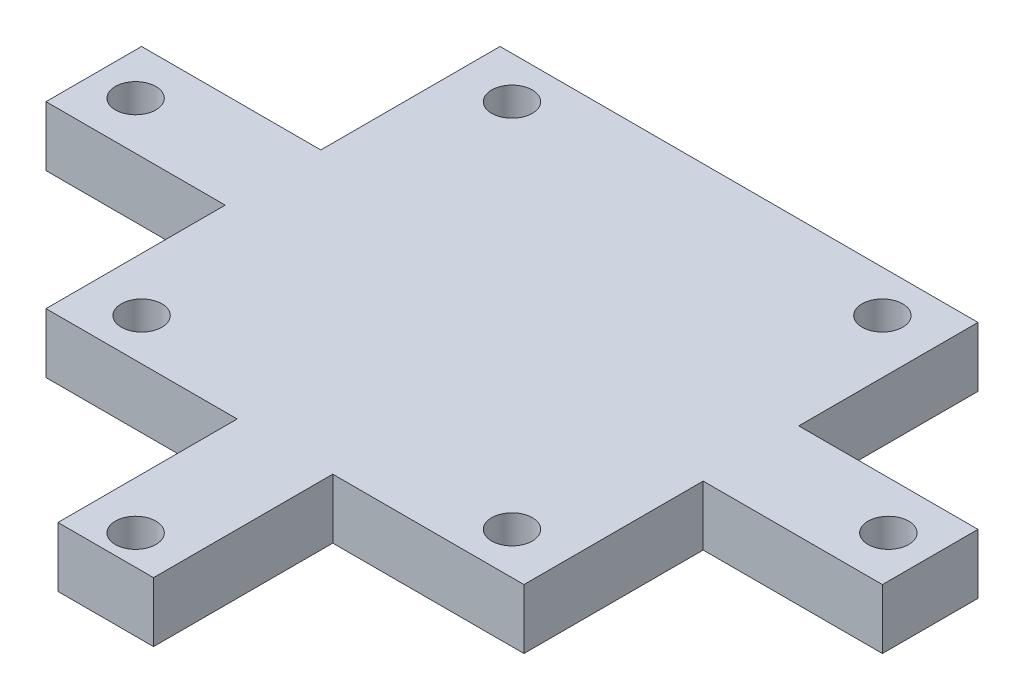
ISO-10303-21;
HEADER;
FILE_DESCRIPTION(('STEP AP214'),'2;1');
FILE_NAME('part.step','',(''),(''),'','','');
FILE_SCHEMA(('AUTOMOTIVE_DESIGN { 1 0 10303 214 1 1 1 1 }'));
ENDSEC;
DATA;
#1=APPLICATION_CONTEXT('core data for automotive mechanical design processes');
#2=APPLICATION_PROTOCOL_DEFINITION('international standard','automotive_design',2000,#1);
#3=PRODUCT_CONTEXT('',#1,'mechanical');
#4=PRODUCT('Part','Part','',(#3));
#5=PRODUCT_RELATED_PRODUCT_CATEGORY('part','',(#4));
#6=PRODUCT_DEFINITION_FORMATION('','',#4);
#7=PRODUCT_DEFINITION_CONTEXT('part definition',#1,'design');
#8=PRODUCT_DEFINITION('design','',#6,#7);
#9=PRODUCT_DEFINITION_SHAPE('','',#8);
#10=(LENGTH_UNIT() NAMED_UNIT(*) SI_UNIT(.MILLI.,.METRE.));
#11=(NAMED_UNIT(*) PLANE_ANGLE_UNIT() SI_UNIT($,.RADIAN.));
#12=(NAMED_UNIT(*) SI_UNIT($,.STERADIAN.) SOLID_ANGLE_UNIT());
#13=UNCERTAINTY_MEASURE_WITH_UNIT(LENGTH_MEASURE(1.E-05),#10,'distance_accuracy_value','');
#14=(GEOMETRIC_REPRESENTATION_CONTEXT(3) GLOBAL_UNCERTAINTY_ASSIGNED_CONTEXT((#13)) GLOBAL_UNIT_ASSIGNED_CONTEXT((#10,
#11,#12)) REPRESENTATION_CONTEXT('',''));
#15=CARTESIAN_POINT('',(0.,0.,0.));
#16=DIRECTION('',(0.,0.,1.));
#17=DIRECTION('',(1.,0.,0.));
#18=AXIS2_PLACEMENT_3D('',#15,#16,#17);
#19=CARTESIAN_POINT('',(0.,5.,0.));
#20=DIRECTION('',(0.,1.,0.));
#21=DIRECTION('',(0.,0.,1.));
#22=AXIS2_PLACEMENT_3D('',#19,#20,#21);
#23=PLANE('',#22);
#24=CARTESIAN_POINT('',(1.09981662173559E-13,5.,31.5));
#25=DIRECTION('',(0.,1.,0.));
#26=DIRECTION('',(0.,0.,1.));
#27=AXIS2_PLACEMENT_3D('',#24,#25,#26);
#28=CIRCLE('',#27,1.7);
#29=CARTESIAN_POINT('',(1.09981662173559E-13,5.,33.2));
#30=VERTEX_POINT('',#29);
#31=EDGE_CURVE('E355',#30,#30,#28,.T.);
#32=ORIENTED_EDGE('',*,*,#31,.F.);
#33=EDGE_LOOP('',(#32));
#34=FACE_BOUND('',#33,.T.);
#35=CARTESIAN_POINT('',(-15.4999999999991,5.,15.5));
#36=DIRECTION('',(0.,1.,0.));
#37=DIRECTION('',(0.,0.,1.));
#38=AXIS2_PLACEMENT_3D('',#35,#36,#37);
#39=CIRCLE('',#38,1.70000000000046);
#40=CARTESIAN_POINT('',(-15.4999999999991,5.,17.2000000000005));
#41=VERTEX_POINT('',#40);
#42=EDGE_CURVE('E367',#41,#41,#39,.T.);
#43=ORIENTED_EDGE('',*,*,#42,.F.);
#44=EDGE_LOOP('',(#43));
#45=FACE_BOUND('',#44,.T.);
#46=CARTESIAN_POINT('',(15.5,5.,-15.5000000000009));
#47=DIRECTION('',(0.,1.,0.));
#48=DIRECTION('',(0.,0.,1.));
#49=AXIS2_PLACEMENT_3D('',#46,#47,#48);
#50=CIRCLE('',#49,1.7000000000009);
#51=CARTESIAN_POINT('',(15.5,5.,-13.8));
#52=VERTEX_POINT('',#51);
#53=EDGE_CURVE('E379',#52,#52,#50,.T.);
#54=ORIENTED_EDGE('',*,*,#53,.F.);
#55=EDGE_LOOP('',(#54));
#56=FACE_BOUND('',#55,.T.);
#57=DIRECTION('',(0.,0.,1.));
#58=VECTOR('',#57,1.);
#59=CARTESIAN_POINT('',(-35.,5.,-4.));
#60=LINE('',#59,#58);
#61=CARTESIAN_POINT('',(-35.,5.,-4.));
#62=VERTEX_POINT('',#61);
#63=CARTESIAN_POINT('',(-35.,5.,4.));
#64=VERTEX_POINT('',#63);
#65=EDGE_CURVE('E209',#62,#64,#60,.T.);
#66=ORIENTED_EDGE('',*,*,#65,.T.);
#67=DIRECTION('',(1.,0.,0.));
#68=VECTOR('',#67,1.);
#69=CARTESIAN_POINT('',(-35.,5.,4.));
#70=LINE('',#69,#68);
#71=CARTESIAN_POINT('',(-20.,5.,4.));
#72=VERTEX_POINT('',#71);
#73=EDGE_CURVE('E117',#64,#72,#70,.T.);
#74=ORIENTED_EDGE('',*,*,#73,.T.);
#75=DIRECTION('',(0.,0.,1.));
#76=VECTOR('',#75,1.);
#77=CARTESIAN_POINT('',(-20.,5.,4.));
#78=LINE('',#77,#76);
#79=CARTESIAN_POINT('',(-20.,5.,19.));
#80=VERTEX_POINT('',#79);
#81=EDGE_CURVE('E248',#72,#80,#78,.T.);
#82=ORIENTED_EDGE('',*,*,#81,.T.);
#83=DIRECTION('',(1.,0.,0.));
#84=VECTOR('',#83,1.);
#85=CARTESIAN_POINT('',(-20.,5.,19.));
#86=LINE('',#85,#84);
#87=CARTESIAN_POINT('',(-4.,5.,19.));
#88=VERTEX_POINT('',#87);
#89=EDGE_CURVE('E267',#80,#88,#86,.T.);
#90=ORIENTED_EDGE('',*,*,#89,.T.);
#91=DIRECTION('',(0.,0.,1.));
#92=VECTOR('',#91,1.);
#93=CARTESIAN_POINT('',(-4.,5.,19.));
#94=LINE('',#93,#92);
#95=CARTESIAN_POINT('',(-4.,5.,34.));
#96=VERTEX_POINT('',#95);
#97=EDGE_CURVE('E264',#88,#96,#94,.T.);
#98=ORIENTED_EDGE('',*,*,#97,.T.);
#99=DIRECTION('',(1.,0.,0.));
#100=VECTOR('',#99,1.);
#101=CARTESIAN_POINT('',(-4.,5.,34.));
#102=LINE('',#101,#100);
#103=CARTESIAN_POINT('',(4.,5.,34.));
#104=VERTEX_POINT('',#103);
#105=EDGE_CURVE('E266',#96,#104,#102,.T.);
#106=ORIENTED_EDGE('',*,*,#105,.T.);
#107=DIRECTION('',(0.,0.,-1.));
#108=VECTOR('',#107,1.);
#109=CARTESIAN_POINT('',(4.,5.,34.));
#110=LINE('',#109,#108);
#111=CARTESIAN_POINT('',(4.,5.,19.));
#112=VERTEX_POINT('',#111);
#113=EDGE_CURVE('E269',#104,#112,#110,.T.);
#114=ORIENTED_EDGE('',*,*,#113,.T.);
#115=DIRECTION('',(1.,0.,0.));
#116=VECTOR('',#115,1.);
#117=CARTESIAN_POINT('',(4.,5.,19.));
#118=LINE('',#117,#116);
#119=CARTESIAN_POINT('',(20.,5.,19.));
#120=VERTEX_POINT('',#119);
#121=EDGE_CURVE('E275',#112,#120,#118,.T.);
#122=ORIENTED_EDGE('',*,*,#121,.T.);
#123=DIRECTION('',(0.,0.,-1.));
#124=VECTOR('',#123,1.);
#125=CARTESIAN_POINT('',(20.,5.,19.));
#126=LINE('',#125,#124);
#127=CARTESIAN_POINT('',(20.,5.,4.));
#128=VERTEX_POINT('',#127);
#129=EDGE_CURVE('E277',#120,#128,#126,.T.);
#130=ORIENTED_EDGE('',*,*,#129,.T.);
#131=DIRECTION('',(1.,0.,0.));
#132=VECTOR('',#131,1.);
#133=CARTESIAN_POINT('',(20.,5.,4.));
#134=LINE('',#133,#132);
#135=CARTESIAN_POINT('',(35.,5.,4.));
#136=VERTEX_POINT('',#135);
#137=EDGE_CURVE('E279',#128,#136,#134,.T.);
#138=ORIENTED_EDGE('',*,*,#137,.T.);
#139=DIRECTION('',(0.,0.,-1.));
#140=VECTOR('',#139,1.);
#141=CARTESIAN_POINT('',(35.,5.,-4.));
#142=LINE('',#141,#140);
#143=CARTESIAN_POINT('',(35.,5.,-4.));
#144=VERTEX_POINT('',#143);
#145=EDGE_CURVE('E281',#136,#144,#142,.T.);
#146=ORIENTED_EDGE('',*,*,#145,.T.);
#147=DIRECTION('',(-1.,0.,0.));
#148=VECTOR('',#147,1.);
#149=CARTESIAN_POINT('',(20.,5.,-4.));
#150=LINE('',#149,#148);
#151=CARTESIAN_POINT('',(20.,5.,-4.));
#152=VERTEX_POINT('',#151);
#153=EDGE_CURVE('E283',#144,#152,#150,.T.);
#154=ORIENTED_EDGE('',*,*,#153,.T.);
#155=DIRECTION('',(0.,0.,-1.));
#156=VECTOR('',#155,1.);
#157=CARTESIAN_POINT('',(20.,5.,-19.));
#158=LINE('',#157,#156);
#159=CARTESIAN_POINT('',(20.,5.,-19.));
#160=VERTEX_POINT('',#159);
#161=EDGE_CURVE('E160',#152,#160,#158,.T.);
#162=ORIENTED_EDGE('',*,*,#161,.T.);
#163=DIRECTION('',(-1.,0.,0.));
#164=VECTOR('',#163,1.);
#165=CARTESIAN_POINT('',(-20.,5.,-19.));
#166=LINE('',#165,#164);
#167=CARTESIAN_POINT('',(-20.,5.,-19.));
#168=VERTEX_POINT('',#167);
#169=EDGE_CURVE('E154',#160,#168,#166,.T.);
#170=ORIENTED_EDGE('',*,*,#169,.T.);
#171=DIRECTION('',(0.,0.,1.));
#172=VECTOR('',#171,1.);
#173=CARTESIAN_POINT('',(-20.,5.,-4.));
#174=LINE('',#173,#172);
#175=CARTESIAN_POINT('',(-20.,5.,-4.));
#176=VERTEX_POINT('',#175);
#177=EDGE_CURVE('E158',#168,#176,#174,.T.);
#178=ORIENTED_EDGE('',*,*,#177,.T.);
#179=DIRECTION('',(-1.,0.,0.));
#180=VECTOR('',#179,1.);
#181=CARTESIAN_POINT('',(-35.,5.,-4.));
#182=LINE('',#181,#180);
#183=EDGE_CURVE('E50',#176,#62,#182,.T.);
#184=ORIENTED_EDGE('',*,*,#183,.T.);
#185=EDGE_LOOP('',(#66,#74,#82,#90,#98,#106,#114,#122,#130,#138,#146,#154,#162,#170,#178,#184));
#186=FACE_BOUND('',#185,.T.);
#187=CARTESIAN_POINT('',(-15.5,5.,-15.5));
#188=DIRECTION('',(0.,1.,0.));
#189=DIRECTION('',(0.,0.,1.));
#190=AXIS2_PLACEMENT_3D('',#187,#188,#189);
#191=CIRCLE('',#190,1.7);
#192=CARTESIAN_POINT('',(-15.5,5.,-13.8));
#193=VERTEX_POINT('',#192);
#194=EDGE_CURVE('E182',#193,#193,#191,.T.);
#195=ORIENTED_EDGE('',*,*,#194,.F.);
#196=EDGE_LOOP('',(#195));
#197=FACE_BOUND('',#196,.T.);
#198=CARTESIAN_POINT('',(15.5000000000009,5.,15.4999999999991));
#199=DIRECTION('',(0.,1.,0.));
#200=DIRECTION('',(0.,0.,1.));
#201=AXIS2_PLACEMENT_3D('',#198,#199,#200);
#202=CIRCLE('',#201,1.70000000000122);
#203=CARTESIAN_POINT('',(15.5000000000009,5.,17.2000000000003));
#204=VERTEX_POINT('',#203);
#205=EDGE_CURVE('E373',#204,#204,#202,.T.);
#206=ORIENTED_EDGE('',*,*,#205,.F.);
#207=EDGE_LOOP('',(#206));
#208=FACE_BOUND('',#207,.T.);
#209=CARTESIAN_POINT('',(-31.5,5.,0.));
#210=DIRECTION('',(0.,1.,0.));
#211=DIRECTION('',(0.,0.,1.));
#212=AXIS2_PLACEMENT_3D('',#209,#210,#211);
#213=CIRCLE('',#212,1.7);
#214=CARTESIAN_POINT('',(-31.5,5.,1.7));
#215=VERTEX_POINT('',#214);
#216=EDGE_CURVE('E361',#215,#215,#213,.T.);
#217=ORIENTED_EDGE('',*,*,#216,.F.);
#218=EDGE_LOOP('',(#217));
#219=FACE_BOUND('',#218,.T.);
#220=CARTESIAN_POINT('',(31.5,5.,-2.19963324347117E-13));
#221=DIRECTION('',(0.,1.,0.));
#222=DIRECTION('',(0.,0.,1.));
#223=AXIS2_PLACEMENT_3D('',#220,#221,#222);
#224=CIRCLE('',#223,1.7);
#225=CARTESIAN_POINT('',(31.5,5.,1.69999999999978));
#226=VERTEX_POINT('',#225);
#227=EDGE_CURVE('E346',#226,#226,#224,.T.);
#228=ORIENTED_EDGE('',*,*,#227,.F.);
#229=EDGE_LOOP('',(#228));
#230=FACE_BOUND('',#229,.T.);
#231=ADVANCED_FACE('F33',(#34,#45,#56,#186,#197,#208,#219,#230),#23,.T.);
#232=CARTESIAN_POINT('',(0.,0.,0.));
#233=DIRECTION('',(0.,1.,0.));
#234=DIRECTION('',(0.,0.,1.));
#235=AXIS2_PLACEMENT_3D('',#232,#233,#234);
#236=PLANE('',#235);
#237=DIRECTION('',(0.,0.,1.));
#238=VECTOR('',#237,1.);
#239=CARTESIAN_POINT('',(-35.,0.,-4.));
#240=LINE('',#239,#238);
#241=CARTESIAN_POINT('',(-35.,0.,-4.));
#242=VERTEX_POINT('',#241);
#243=CARTESIAN_POINT('',(-35.,0.,4.));
#244=VERTEX_POINT('',#243);
#245=EDGE_CURVE('E178',#242,#244,#240,.T.);
#246=ORIENTED_EDGE('',*,*,#245,.F.);
#247=DIRECTION('',(-1.,0.,0.));
#248=VECTOR('',#247,1.);
#249=CARTESIAN_POINT('',(-35.,0.,-4.));
#250=LINE('',#249,#248);
#251=CARTESIAN_POINT('',(-20.,0.,-4.));
#252=VERTEX_POINT('',#251);
#253=EDGE_CURVE('E109',#252,#242,#250,.T.);
#254=ORIENTED_EDGE('',*,*,#253,.F.);
#255=DIRECTION('',(0.,0.,1.));
#256=VECTOR('',#255,1.);
#257=CARTESIAN_POINT('',(-20.,0.,-4.));
#258=LINE('',#257,#256);
#259=CARTESIAN_POINT('',(-20.,0.,-19.));
#260=VERTEX_POINT('',#259);
#261=EDGE_CURVE('E103',#260,#252,#258,.T.);
#262=ORIENTED_EDGE('',*,*,#261,.F.);
#263=DIRECTION('',(-1.,0.,0.));
#264=VECTOR('',#263,1.);
#265=CARTESIAN_POINT('',(-20.,0.,-19.));
#266=LINE('',#265,#264);
#267=CARTESIAN_POINT('',(20.,0.,-19.));
#268=VERTEX_POINT('',#267);
#269=EDGE_CURVE('E168',#268,#260,#266,.T.);
#270=ORIENTED_EDGE('',*,*,#269,.F.);
#271=DIRECTION('',(0.,0.,-1.));
#272=VECTOR('',#271,1.);
#273=CARTESIAN_POINT('',(20.,0.,-19.));
#274=LINE('',#273,#272);
#275=CARTESIAN_POINT('',(20.,0.,-4.));
#276=VERTEX_POINT('',#275);
#277=EDGE_CURVE('E204',#276,#268,#274,.T.);
#278=ORIENTED_EDGE('',*,*,#277,.F.);
#279=DIRECTION('',(-1.,0.,0.));
#280=VECTOR('',#279,1.);
#281=CARTESIAN_POINT('',(20.,0.,-4.));
#282=LINE('',#281,#280);
#283=CARTESIAN_POINT('',(35.,0.,-4.));
#284=VERTEX_POINT('',#283);
#285=EDGE_CURVE('E202',#284,#276,#282,.T.);
#286=ORIENTED_EDGE('',*,*,#285,.F.);
#287=DIRECTION('',(0.,0.,-1.));
#288=VECTOR('',#287,1.);
#289=CARTESIAN_POINT('',(35.,0.,-4.));
#290=LINE('',#289,#288);
#291=CARTESIAN_POINT('',(35.,0.,4.));
#292=VERTEX_POINT('',#291);
#293=EDGE_CURVE('E200',#292,#284,#290,.T.);
#294=ORIENTED_EDGE('',*,*,#293,.F.);
#295=DIRECTION('',(1.,0.,0.));
#296=VECTOR('',#295,1.);
#297=CARTESIAN_POINT('',(20.,0.,4.));
#298=LINE('',#297,#296);
#299=CARTESIAN_POINT('',(20.,0.,4.));
#300=VERTEX_POINT('',#299);
#301=EDGE_CURVE('E198',#300,#292,#298,.T.);
#302=ORIENTED_EDGE('',*,*,#301,.F.);
#303=DIRECTION('',(0.,0.,-1.));
#304=VECTOR('',#303,1.);
#305=CARTESIAN_POINT('',(20.,0.,19.));
#306=LINE('',#305,#304);
#307=CARTESIAN_POINT('',(20.,0.,19.));
#308=VERTEX_POINT('',#307);
#309=EDGE_CURVE('E196',#308,#300,#306,.T.);
#310=ORIENTED_EDGE('',*,*,#309,.F.);
#311=DIRECTION('',(1.,0.,0.));
#312=VECTOR('',#311,1.);
#313=CARTESIAN_POINT('',(4.,0.,19.));
#314=LINE('',#313,#312);
#315=CARTESIAN_POINT('',(4.,0.,19.));
#316=VERTEX_POINT('',#315);
#317=EDGE_CURVE('E194',#316,#308,#314,.T.);
#318=ORIENTED_EDGE('',*,*,#317,.F.);
#319=DIRECTION('',(0.,0.,-1.));
#320=VECTOR('',#319,1.);
#321=CARTESIAN_POINT('',(4.,0.,34.));
#322=LINE('',#321,#320);
#323=CARTESIAN_POINT('',(4.,0.,34.));
#324=VERTEX_POINT('',#323);
#325=EDGE_CURVE('E192',#324,#316,#322,.T.);
#326=ORIENTED_EDGE('',*,*,#325,.F.);
#327=DIRECTION('',(1.,0.,0.));
#328=VECTOR('',#327,1.);
#329=CARTESIAN_POINT('',(-4.,0.,34.));
#330=LINE('',#329,#328);
#331=CARTESIAN_POINT('',(-4.,0.,34.));
#332=VERTEX_POINT('',#331);
#333=EDGE_CURVE('E190',#332,#324,#330,.T.);
#334=ORIENTED_EDGE('',*,*,#333,.F.);
#335=DIRECTION('',(0.,0.,1.));
#336=VECTOR('',#335,1.);
#337=CARTESIAN_POINT('',(-4.,0.,19.));
#338=LINE('',#337,#336);
#339=CARTESIAN_POINT('',(-4.,0.,19.));
#340=VERTEX_POINT('',#339);
#341=EDGE_CURVE('E188',#340,#332,#338,.T.);
#342=ORIENTED_EDGE('',*,*,#341,.F.);
#343=DIRECTION('',(1.,0.,0.));
#344=VECTOR('',#343,1.);
#345=CARTESIAN_POINT('',(-20.,0.,19.));
#346=LINE('',#345,#344);
#347=CARTESIAN_POINT('',(-20.,0.,19.));
#348=VERTEX_POINT('',#347);
#349=EDGE_CURVE('E186',#348,#340,#346,.T.);
#350=ORIENTED_EDGE('',*,*,#349,.F.);
#351=DIRECTION('',(0.,0.,1.));
#352=VECTOR('',#351,1.);
#353=CARTESIAN_POINT('',(-20.,0.,4.));
#354=LINE('',#353,#352);
#355=CARTESIAN_POINT('',(-20.,0.,4.));
#356=VERTEX_POINT('',#355);
#357=EDGE_CURVE('E184',#356,#348,#354,.T.);
#358=ORIENTED_EDGE('',*,*,#357,.F.);
#359=DIRECTION('',(1.,0.,0.));
#360=VECTOR('',#359,1.);
#361=CARTESIAN_POINT('',(-35.,0.,4.));
#362=LINE('',#361,#360);
#363=EDGE_CURVE('E181',#244,#356,#362,.T.);
#364=ORIENTED_EDGE('',*,*,#363,.F.);
#365=EDGE_LOOP('',(#246,#254,#262,#270,#278,#286,#294,#302,#310,#318,#326,#334,#342,#350,#358,#364));
#366=FACE_BOUND('',#365,.T.);
#367=CARTESIAN_POINT('',(-15.5,0.,-15.5));
#368=DIRECTION('',(0.,1.,0.));
#369=DIRECTION('',(0.,0.,1.));
#370=AXIS2_PLACEMENT_3D('',#367,#368,#369);
#371=CIRCLE('',#370,1.7);
#372=CARTESIAN_POINT('',(-15.5,0.,-13.8));
#373=VERTEX_POINT('',#372);
#374=EDGE_CURVE('E382',#373,#373,#371,.T.);
#375=ORIENTED_EDGE('',*,*,#374,.T.);
#376=EDGE_LOOP('',(#375));
#377=FACE_BOUND('',#376,.T.);
#378=CARTESIAN_POINT('',(15.5,0.,-15.5000000000009));
#379=DIRECTION('',(0.,1.,0.));
#380=DIRECTION('',(0.,0.,1.));
#381=AXIS2_PLACEMENT_3D('',#378,#379,#380);
#382=CIRCLE('',#381,1.7000000000009);
#383=CARTESIAN_POINT('',(15.5,0.,-13.8));
#384=VERTEX_POINT('',#383);
#385=EDGE_CURVE('E376',#384,#384,#382,.T.);
#386=ORIENTED_EDGE('',*,*,#385,.T.);
#387=EDGE_LOOP('',(#386));
#388=FACE_BOUND('',#387,.T.);
#389=CARTESIAN_POINT('',(15.5000000000009,0.,15.4999999999991));
#390=DIRECTION('',(0.,1.,0.));
#391=DIRECTION('',(0.,0.,1.));
#392=AXIS2_PLACEMENT_3D('',#389,#390,#391);
#393=CIRCLE('',#392,1.70000000000122);
#394=CARTESIAN_POINT('',(15.5000000000009,0.,17.2000000000003));
#395=VERTEX_POINT('',#394);
#396=EDGE_CURVE('E370',#395,#395,#393,.T.);
#397=ORIENTED_EDGE('',*,*,#396,.T.);
#398=EDGE_LOOP('',(#397));
#399=FACE_BOUND('',#398,.T.);
#400=CARTESIAN_POINT('',(-15.4999999999991,0.,15.5));
#401=DIRECTION('',(0.,1.,0.));
#402=DIRECTION('',(0.,0.,1.));
#403=AXIS2_PLACEMENT_3D('',#400,#401,#402);
#404=CIRCLE('',#403,1.70000000000046);
#405=CARTESIAN_POINT('',(-15.4999999999991,0.,17.2000000000005));
#406=VERTEX_POINT('',#405);
#407=EDGE_CURVE('E364',#406,#406,#404,.T.);
#408=ORIENTED_EDGE('',*,*,#407,.T.);
#409=EDGE_LOOP('',(#408));
#410=FACE_BOUND('',#409,.T.);
#411=CARTESIAN_POINT('',(-31.5,0.,0.));
#412=DIRECTION('',(0.,1.,0.));
#413=DIRECTION('',(0.,0.,1.));
#414=AXIS2_PLACEMENT_3D('',#411,#412,#413);
#415=CIRCLE('',#414,1.7);
#416=CARTESIAN_POINT('',(-31.5,0.,1.7));
#417=VERTEX_POINT('',#416);
#418=EDGE_CURVE('E358',#417,#417,#415,.T.);
#419=ORIENTED_EDGE('',*,*,#418,.T.);
#420=EDGE_LOOP('',(#419));
#421=FACE_BOUND('',#420,.T.);
#422=CARTESIAN_POINT('',(1.09981662173559E-13,0.,31.5));
#423=DIRECTION('',(0.,1.,0.));
#424=DIRECTION('',(0.,0.,1.));
#425=AXIS2_PLACEMENT_3D('',#422,#423,#424);
#426=CIRCLE('',#425,1.7);
#427=CARTESIAN_POINT('',(1.09981662173559E-13,0.,33.2));
#428=VERTEX_POINT('',#427);
#429=EDGE_CURVE('E352',#428,#428,#426,.T.);
#430=ORIENTED_EDGE('',*,*,#429,.T.);
#431=EDGE_LOOP('',(#430));
#432=FACE_BOUND('',#431,.T.);
#433=CARTESIAN_POINT('',(31.5,0.,-2.19963324347117E-13));
#434=DIRECTION('',(0.,1.,0.));
#435=DIRECTION('',(0.,0.,1.));
#436=AXIS2_PLACEMENT_3D('',#433,#434,#435);
#437=CIRCLE('',#436,1.7);
#438=CARTESIAN_POINT('',(31.5,0.,1.69999999999978));
#439=VERTEX_POINT('',#438);
#440=EDGE_CURVE('E349',#439,#439,#437,.T.);
#441=ORIENTED_EDGE('',*,*,#440,.T.);
#442=EDGE_LOOP('',(#441));
#443=FACE_BOUND('',#442,.T.);
#444=ADVANCED_FACE('F252',(#366,#377,#388,#399,#410,#421,#432,#443),#236,.F.);
#445=CARTESIAN_POINT('',(-35.,5.,-4.));
#446=DIRECTION('',(1.,0.,0.));
#447=DIRECTION('',(0.,0.,-1.));
#448=AXIS2_PLACEMENT_3D('',#445,#446,#447);
#449=PLANE('',#448);
#450=ORIENTED_EDGE('',*,*,#245,.T.);
#451=DIRECTION('',(0.,-1.,0.));
#452=VECTOR('',#451,1.);
#453=CARTESIAN_POINT('',(-35.,5.,4.));
#454=LINE('',#453,#452);
#455=EDGE_CURVE('E11',#64,#244,#454,.T.);
#456=ORIENTED_EDGE('',*,*,#455,.F.);
#457=ORIENTED_EDGE('',*,*,#65,.F.);
#458=DIRECTION('',(0.,-1.,0.));
#459=VECTOR('',#458,1.);
#460=CARTESIAN_POINT('',(-35.,5.,-4.));
#461=LINE('',#460,#459);
#462=EDGE_CURVE('E174',#62,#242,#461,.T.);
#463=ORIENTED_EDGE('',*,*,#462,.T.);
#464=EDGE_LOOP('',(#450,#456,#457,#463));
#465=FACE_BOUND('',#464,.T.);
#466=ADVANCED_FACE('F35',(#465),#449,.F.);
#467=CARTESIAN_POINT('',(-35.,5.,4.));
#468=DIRECTION('',(0.,0.,-1.));
#469=DIRECTION('',(-1.,0.,0.));
#470=AXIS2_PLACEMENT_3D('',#467,#468,#469);
#471=PLANE('',#470);
#472=ORIENTED_EDGE('',*,*,#363,.T.);
#473=DIRECTION('',(0.,-1.,0.));
#474=VECTOR('',#473,1.);
#475=CARTESIAN_POINT('',(-20.,5.,4.));
#476=LINE('',#475,#474);
#477=EDGE_CURVE('E42',#72,#356,#476,.T.);
#478=ORIENTED_EDGE('',*,*,#477,.F.);
#479=ORIENTED_EDGE('',*,*,#73,.F.);
#480=ORIENTED_EDGE('',*,*,#455,.T.);
#481=EDGE_LOOP('',(#472,#478,#479,#480));
#482=FACE_BOUND('',#481,.T.);
#483=ADVANCED_FACE('F559',(#482),#471,.F.);
#484=CARTESIAN_POINT('',(-20.,5.,4.));
#485=DIRECTION('',(1.,0.,0.));
#486=DIRECTION('',(0.,0.,-1.));
#487=AXIS2_PLACEMENT_3D('',#484,#485,#486);
#488=PLANE('',#487);
#489=ORIENTED_EDGE('',*,*,#357,.T.);
#490=DIRECTION('',(0.,-1.,0.));
#491=VECTOR('',#490,1.);
#492=CARTESIAN_POINT('',(-20.,5.,19.));
#493=LINE('',#492,#491);
#494=EDGE_CURVE('E240',#80,#348,#493,.T.);
#495=ORIENTED_EDGE('',*,*,#494,.F.);
#496=ORIENTED_EDGE('',*,*,#81,.F.);
#497=ORIENTED_EDGE('',*,*,#477,.T.);
#498=EDGE_LOOP('',(#489,#495,#496,#497));
#499=FACE_BOUND('',#498,.T.);
#500=ADVANCED_FACE('F246',(#499),#488,.F.);
#501=CARTESIAN_POINT('',(-20.,5.,19.));
#502=DIRECTION('',(0.,0.,-1.));
#503=DIRECTION('',(-1.,0.,0.));
#504=AXIS2_PLACEMENT_3D('',#501,#502,#503);
#505=PLANE('',#504);
#506=ORIENTED_EDGE('',*,*,#349,.T.);
#507=DIRECTION('',(0.,-1.,0.));
#508=VECTOR('',#507,1.);
#509=CARTESIAN_POINT('',(-4.,5.,19.));
#510=LINE('',#509,#508);
#511=EDGE_CURVE('E237',#88,#340,#510,.T.);
#512=ORIENTED_EDGE('',*,*,#511,.F.);
#513=ORIENTED_EDGE('',*,*,#89,.F.);
#514=ORIENTED_EDGE('',*,*,#494,.T.);
#515=EDGE_LOOP('',(#506,#512,#513,#514));
#516=FACE_BOUND('',#515,.T.);
#517=ADVANCED_FACE('F258',(#516),#505,.F.);
#518=CARTESIAN_POINT('',(-4.,5.,19.));
#519=DIRECTION('',(1.,0.,0.));
#520=DIRECTION('',(0.,0.,-1.));
#521=AXIS2_PLACEMENT_3D('',#518,#519,#520);
#522=PLANE('',#521);
#523=ORIENTED_EDGE('',*,*,#341,.T.);
#524=DIRECTION('',(0.,-1.,0.));
#525=VECTOR('',#524,1.);
#526=CARTESIAN_POINT('',(-4.,5.,34.));
#527=LINE('',#526,#525);
#528=EDGE_CURVE('E234',#96,#332,#527,.T.);
#529=ORIENTED_EDGE('',*,*,#528,.F.);
#530=ORIENTED_EDGE('',*,*,#97,.F.);
#531=ORIENTED_EDGE('',*,*,#511,.T.);
#532=EDGE_LOOP('',(#523,#529,#530,#531));
#533=FACE_BOUND('',#532,.T.);
#534=ADVANCED_FACE('F262',(#533),#522,.F.);
#535=CARTESIAN_POINT('',(-4.,5.,34.));
#536=DIRECTION('',(0.,0.,-1.));
#537=DIRECTION('',(-1.,0.,0.));
#538=AXIS2_PLACEMENT_3D('',#535,#536,#537);
#539=PLANE('',#538);
#540=ORIENTED_EDGE('',*,*,#333,.T.);
#541=DIRECTION('',(0.,-1.,0.));
#542=VECTOR('',#541,1.);
#543=CARTESIAN_POINT('',(4.,5.,34.));
#544=LINE('',#543,#542);
#545=EDGE_CURVE('E231',#104,#324,#544,.T.);
#546=ORIENTED_EDGE('',*,*,#545,.F.);
#547=ORIENTED_EDGE('',*,*,#105,.F.);
#548=ORIENTED_EDGE('',*,*,#528,.T.);
#549=EDGE_LOOP('',(#540,#546,#547,#548));
#550=FACE_BOUND('',#549,.T.);
#551=ADVANCED_FACE('F524',(#550),#539,.F.);
#552=CARTESIAN_POINT('',(4.,5.,34.));
#553=DIRECTION('',(-1.,0.,0.));
#554=DIRECTION('',(0.,0.,1.));
#555=AXIS2_PLACEMENT_3D('',#552,#553,#554);
#556=PLANE('',#555);
#557=ORIENTED_EDGE('',*,*,#325,.T.);
#558=DIRECTION('',(0.,-1.,0.));
#559=VECTOR('',#558,1.);
#560=CARTESIAN_POINT('',(4.,5.,19.));
#561=LINE('',#560,#559);
#562=EDGE_CURVE('E228',#112,#316,#561,.T.);
#563=ORIENTED_EDGE('',*,*,#562,.F.);
#564=ORIENTED_EDGE('',*,*,#113,.F.);
#565=ORIENTED_EDGE('',*,*,#545,.T.);
#566=EDGE_LOOP('',(#557,#563,#564,#565));
#567=FACE_BOUND('',#566,.T.);
#568=ADVANCED_FACE('F514',(#567),#556,.F.);
#569=CARTESIAN_POINT('',(4.,5.,19.));
#570=DIRECTION('',(0.,0.,-1.));
#571=DIRECTION('',(-1.,0.,0.));
#572=AXIS2_PLACEMENT_3D('',#569,#570,#571);
#573=PLANE('',#572);
#574=ORIENTED_EDGE('',*,*,#317,.T.);
#575=DIRECTION('',(0.,-1.,0.));
#576=VECTOR('',#575,1.);
#577=CARTESIAN_POINT('',(20.,5.,19.));
#578=LINE('',#577,#576);
#579=EDGE_CURVE('E225',#120,#308,#578,.T.);
#580=ORIENTED_EDGE('',*,*,#579,.F.);
#581=ORIENTED_EDGE('',*,*,#121,.F.);
#582=ORIENTED_EDGE('',*,*,#562,.T.);
#583=EDGE_LOOP('',(#574,#580,#581,#582));
#584=FACE_BOUND('',#583,.T.);
#585=ADVANCED_FACE('F504',(#584),#573,.F.);
#586=CARTESIAN_POINT('',(20.,5.,19.));
#587=DIRECTION('',(-1.,0.,0.));
#588=DIRECTION('',(0.,0.,1.));
#589=AXIS2_PLACEMENT_3D('',#586,#587,#588);
#590=PLANE('',#589);
#591=ORIENTED_EDGE('',*,*,#309,.T.);
#592=DIRECTION('',(0.,-1.,0.));
#593=VECTOR('',#592,1.);
#594=CARTESIAN_POINT('',(20.,5.,4.));
#595=LINE('',#594,#593);
#596=EDGE_CURVE('E222',#128,#300,#595,.T.);
#597=ORIENTED_EDGE('',*,*,#596,.F.);
#598=ORIENTED_EDGE('',*,*,#129,.F.);
#599=ORIENTED_EDGE('',*,*,#579,.T.);
#600=EDGE_LOOP('',(#591,#597,#598,#599));
#601=FACE_BOUND('',#600,.T.);
#602=ADVANCED_FACE('F494',(#601),#590,.F.);
#603=CARTESIAN_POINT('',(20.,5.,4.));
#604=DIRECTION('',(0.,0.,-1.));
#605=DIRECTION('',(-1.,0.,0.));
#606=AXIS2_PLACEMENT_3D('',#603,#604,#605);
#607=PLANE('',#606);
#608=ORIENTED_EDGE('',*,*,#301,.T.);
#609=DIRECTION('',(0.,-1.,0.));
#610=VECTOR('',#609,1.);
#611=CARTESIAN_POINT('',(35.,5.,4.));
#612=LINE('',#611,#610);
#613=EDGE_CURVE('E219',#136,#292,#612,.T.);
#614=ORIENTED_EDGE('',*,*,#613,.F.);
#615=ORIENTED_EDGE('',*,*,#137,.F.);
#616=ORIENTED_EDGE('',*,*,#596,.T.);
#617=EDGE_LOOP('',(#608,#614,#615,#616));
#618=FACE_BOUND('',#617,.T.);
#619=ADVANCED_FACE('F484',(#618),#607,.F.);
#620=CARTESIAN_POINT('',(35.,5.,-4.));
#621=DIRECTION('',(-1.,0.,0.));
#622=DIRECTION('',(0.,0.,1.));
#623=AXIS2_PLACEMENT_3D('',#620,#621,#622);
#624=PLANE('',#623);
#625=ORIENTED_EDGE('',*,*,#293,.T.);
#626=DIRECTION('',(0.,-1.,0.));
#627=VECTOR('',#626,1.);
#628=CARTESIAN_POINT('',(35.,5.,-4.));
#629=LINE('',#628,#627);
#630=EDGE_CURVE('E216',#144,#284,#629,.T.);
#631=ORIENTED_EDGE('',*,*,#630,.F.);
#632=ORIENTED_EDGE('',*,*,#145,.F.);
#633=ORIENTED_EDGE('',*,*,#613,.T.);
#634=EDGE_LOOP('',(#625,#631,#632,#633));
#635=FACE_BOUND('',#634,.T.);
#636=ADVANCED_FACE('F475',(#635),#624,.F.);
#637=CARTESIAN_POINT('',(20.,5.,-4.));
#638=DIRECTION('',(0.,0.,1.));
#639=DIRECTION('',(1.,0.,0.));
#640=AXIS2_PLACEMENT_3D('',#637,#638,#639);
#641=PLANE('',#640);
#642=ORIENTED_EDGE('',*,*,#285,.T.);
#643=DIRECTION('',(0.,-1.,0.));
#644=VECTOR('',#643,1.);
#645=CARTESIAN_POINT('',(20.,5.,-4.));
#646=LINE('',#645,#644);
#647=EDGE_CURVE('E213',#152,#276,#646,.T.);
#648=ORIENTED_EDGE('',*,*,#647,.F.);
#649=ORIENTED_EDGE('',*,*,#153,.F.);
#650=ORIENTED_EDGE('',*,*,#630,.T.);
#651=EDGE_LOOP('',(#642,#648,#649,#650));
#652=FACE_BOUND('',#651,.T.);
#653=ADVANCED_FACE('F289',(#652),#641,.F.);
#654=CARTESIAN_POINT('',(20.,5.,-19.));
#655=DIRECTION('',(-1.,0.,0.));
#656=DIRECTION('',(0.,0.,1.));
#657=AXIS2_PLACEMENT_3D('',#654,#655,#656);
#658=PLANE('',#657);
#659=ORIENTED_EDGE('',*,*,#277,.T.);
#660=DIRECTION('',(0.,-1.,0.));
#661=VECTOR('',#660,1.);
#662=CARTESIAN_POINT('',(20.,5.,-19.));
#663=LINE('',#662,#661);
#664=EDGE_CURVE('E169',#160,#268,#663,.T.);
#665=ORIENTED_EDGE('',*,*,#664,.F.);
#666=ORIENTED_EDGE('',*,*,#161,.F.);
#667=ORIENTED_EDGE('',*,*,#647,.T.);
#668=EDGE_LOOP('',(#659,#665,#666,#667));
#669=FACE_BOUND('',#668,.T.);
#670=ADVANCED_FACE('F293',(#669),#658,.F.);
#671=CARTESIAN_POINT('',(-20.,5.,-19.));
#672=DIRECTION('',(0.,0.,1.));
#673=DIRECTION('',(1.,0.,0.));
#674=AXIS2_PLACEMENT_3D('',#671,#672,#673);
#675=PLANE('',#674);
#676=ORIENTED_EDGE('',*,*,#269,.T.);
#677=DIRECTION('',(0.,-1.,0.));
#678=VECTOR('',#677,1.);
#679=CARTESIAN_POINT('',(-20.,5.,-19.));
#680=LINE('',#679,#678);
#681=EDGE_CURVE('E165',#168,#260,#680,.T.);
#682=ORIENTED_EDGE('',*,*,#681,.F.);
#683=ORIENTED_EDGE('',*,*,#169,.F.);
#684=ORIENTED_EDGE('',*,*,#664,.T.);
#685=EDGE_LOOP('',(#676,#682,#683,#684));
#686=FACE_BOUND('',#685,.T.);
#687=ADVANCED_FACE('F166',(#686),#675,.F.);
#688=CARTESIAN_POINT('',(-20.,5.,-4.));
#689=DIRECTION('',(1.,0.,0.));
#690=DIRECTION('',(0.,0.,-1.));
#691=AXIS2_PLACEMENT_3D('',#688,#689,#690);
#692=PLANE('',#691);
#693=ORIENTED_EDGE('',*,*,#261,.T.);
#694=DIRECTION('',(0.,-1.,0.));
#695=VECTOR('',#694,1.);
#696=CARTESIAN_POINT('',(-20.,5.,-4.));
#697=LINE('',#696,#695);
#698=EDGE_CURVE('E170',#176,#252,#697,.T.);
#699=ORIENTED_EDGE('',*,*,#698,.F.);
#700=ORIENTED_EDGE('',*,*,#177,.F.);
#701=ORIENTED_EDGE('',*,*,#681,.T.);
#702=EDGE_LOOP('',(#693,#699,#700,#701));
#703=FACE_BOUND('',#702,.T.);
#704=ADVANCED_FACE('F172',(#703),#692,.F.);
#705=CARTESIAN_POINT('',(-35.,5.,-4.));
#706=DIRECTION('',(0.,0.,1.));
#707=DIRECTION('',(1.,0.,0.));
#708=AXIS2_PLACEMENT_3D('',#705,#706,#707);
#709=PLANE('',#708);
#710=ORIENTED_EDGE('',*,*,#253,.T.);
#711=ORIENTED_EDGE('',*,*,#462,.F.);
#712=ORIENTED_EDGE('',*,*,#183,.F.);
#713=ORIENTED_EDGE('',*,*,#698,.T.);
#714=EDGE_LOOP('',(#710,#711,#712,#713));
#715=FACE_BOUND('',#714,.T.);
#716=ADVANCED_FACE('F297',(#715),#709,.F.);
#717=CARTESIAN_POINT('',(-15.5,5.,-15.5));
#718=DIRECTION('',(0.,-1.,0.));
#719=DIRECTION('',(0.,0.,-1.));
#720=AXIS2_PLACEMENT_3D('',#717,#718,#719);
#721=CYLINDRICAL_SURFACE('',#720,1.7);
#722=ORIENTED_EDGE('',*,*,#194,.T.);
#723=EDGE_LOOP('',(#722));
#724=FACE_BOUND('',#723,.T.);
#725=ORIENTED_EDGE('',*,*,#374,.F.);
#726=EDGE_LOOP('',(#725));
#727=FACE_BOUND('',#726,.T.);
#728=ADVANCED_FACE('F299',(#724,#727),#721,.F.);
#729=CARTESIAN_POINT('',(15.5,5.,-15.5000000000009));
#730=DIRECTION('',(0.,-1.,0.));
#731=DIRECTION('',(0.,0.,-1.));
#732=AXIS2_PLACEMENT_3D('',#729,#730,#731);
#733=CYLINDRICAL_SURFACE('',#732,1.7000000000009);
#734=ORIENTED_EDGE('',*,*,#53,.T.);
#735=EDGE_LOOP('',(#734));
#736=FACE_BOUND('',#735,.T.);
#737=ORIENTED_EDGE('',*,*,#385,.F.);
#738=EDGE_LOOP('',(#737));
#739=FACE_BOUND('',#738,.T.);
#740=ADVANCED_FACE('F305',(#736,#739),#733,.F.);
#741=CARTESIAN_POINT('',(15.5000000000009,5.,15.4999999999991));
#742=DIRECTION('',(0.,-1.,0.));
#743=DIRECTION('',(0.,0.,-1.));
#744=AXIS2_PLACEMENT_3D('',#741,#742,#743);
#745=CYLINDRICAL_SURFACE('',#744,1.70000000000122);
#746=ORIENTED_EDGE('',*,*,#205,.T.);
#747=EDGE_LOOP('',(#746));
#748=FACE_BOUND('',#747,.T.);
#749=ORIENTED_EDGE('',*,*,#396,.F.);
#750=EDGE_LOOP('',(#749));
#751=FACE_BOUND('',#750,.T.);
#752=ADVANCED_FACE('F321',(#748,#751),#745,.F.);
#753=CARTESIAN_POINT('',(-15.4999999999991,5.,15.5));
#754=DIRECTION('',(0.,-1.,0.));
#755=DIRECTION('',(0.,0.,-1.));
#756=AXIS2_PLACEMENT_3D('',#753,#754,#755);
#757=CYLINDRICAL_SURFACE('',#756,1.70000000000046);
#758=ORIENTED_EDGE('',*,*,#42,.T.);
#759=EDGE_LOOP('',(#758));
#760=FACE_BOUND('',#759,.T.);
#761=ORIENTED_EDGE('',*,*,#407,.F.);
#762=EDGE_LOOP('',(#761));
#763=FACE_BOUND('',#762,.T.);
#764=ADVANCED_FACE('F325',(#760,#763),#757,.F.);
#765=CARTESIAN_POINT('',(-31.5,5.,0.));
#766=DIRECTION('',(0.,-1.,0.));
#767=DIRECTION('',(0.,0.,-1.));
#768=AXIS2_PLACEMENT_3D('',#765,#766,#767);
#769=CYLINDRICAL_SURFACE('',#768,1.7);
#770=ORIENTED_EDGE('',*,*,#216,.T.);
#771=EDGE_LOOP('',(#770));
#772=FACE_BOUND('',#771,.T.);
#773=ORIENTED_EDGE('',*,*,#418,.F.);
#774=EDGE_LOOP('',(#773));
#775=FACE_BOUND('',#774,.T.);
#776=ADVANCED_FACE('F329',(#772,#775),#769,.F.);
#777=CARTESIAN_POINT('',(1.09981662173559E-13,5.,31.5));
#778=DIRECTION('',(0.,-1.,0.));
#779=DIRECTION('',(0.,0.,-1.));
#780=AXIS2_PLACEMENT_3D('',#777,#778,#779);
#781=CYLINDRICAL_SURFACE('',#780,1.7);
#782=ORIENTED_EDGE('',*,*,#31,.T.);
#783=EDGE_LOOP('',(#782));
#784=FACE_BOUND('',#783,.T.);
#785=ORIENTED_EDGE('',*,*,#429,.F.);
#786=EDGE_LOOP('',(#785));
#787=FACE_BOUND('',#786,.T.);
#788=ADVANCED_FACE('F333',(#784,#787),#781,.F.);
#789=CARTESIAN_POINT('',(31.5,5.,-2.19963324347117E-13));
#790=DIRECTION('',(0.,-1.,0.));
#791=DIRECTION('',(0.,0.,-1.));
#792=AXIS2_PLACEMENT_3D('',#789,#790,#791);
#793=CYLINDRICAL_SURFACE('',#792,1.7);
#794=ORIENTED_EDGE('',*,*,#227,.T.);
#795=EDGE_LOOP('',(#794));
#796=FACE_BOUND('',#795,.T.);
#797=ORIENTED_EDGE('',*,*,#440,.F.);
#798=EDGE_LOOP('',(#797));
#799=FACE_BOUND('',#798,.T.);
#800=ADVANCED_FACE('F337',(#796,#799),#793,.F.);
#801=CLOSED_SHELL('',(#231,#444,#466,#483,#500,#517,#534,#551,#568,#585,#602,#619,#636,#653,
#670,#687,#704,#716,#728,#740,#752,#764,#776,#788,#800));
#802=MANIFOLD_SOLID_BREP('B2',#801);
#803=ADVANCED_BREP_SHAPE_REPRESENTATION('',(#18,#802),#14);
#804=SHAPE_DEFINITION_REPRESENTATION(#9,#803);
ENDSEC;
END-ISO-10303-21;
